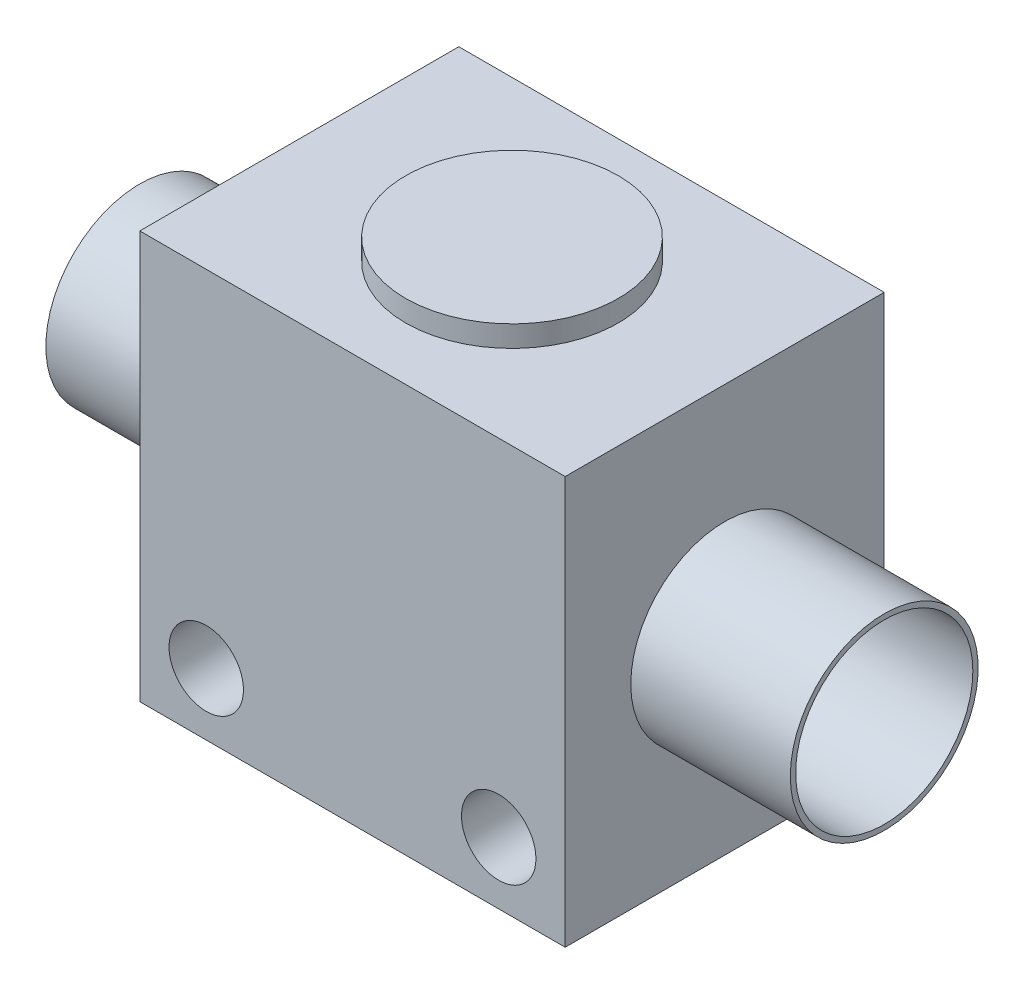
ISO-10303-21;
HEADER;
FILE_DESCRIPTION(('STEP AP214'),'2;1');
FILE_NAME('part.step','',(''),(''),'','','');
FILE_SCHEMA(('AUTOMOTIVE_DESIGN { 1 0 10303 214 1 1 1 1 }'));
ENDSEC;
DATA;
#1=APPLICATION_CONTEXT('core data for automotive mechanical design processes');
#2=APPLICATION_PROTOCOL_DEFINITION('international standard','automotive_design',2000,#1);
#3=PRODUCT_CONTEXT('',#1,'mechanical');
#4=PRODUCT('Part','Part','',(#3));
#5=PRODUCT_RELATED_PRODUCT_CATEGORY('part','',(#4));
#6=PRODUCT_DEFINITION_FORMATION('','',#4);
#7=PRODUCT_DEFINITION_CONTEXT('part definition',#1,'design');
#8=PRODUCT_DEFINITION('design','',#6,#7);
#9=PRODUCT_DEFINITION_SHAPE('','',#8);
#10=(LENGTH_UNIT() NAMED_UNIT(*) SI_UNIT(.MILLI.,.METRE.));
#11=(NAMED_UNIT(*) PLANE_ANGLE_UNIT() SI_UNIT($,.RADIAN.));
#12=(NAMED_UNIT(*) SI_UNIT($,.STERADIAN.) SOLID_ANGLE_UNIT());
#13=UNCERTAINTY_MEASURE_WITH_UNIT(LENGTH_MEASURE(1.E-05),#10,'distance_accuracy_value','');
#14=(GEOMETRIC_REPRESENTATION_CONTEXT(3) GLOBAL_UNCERTAINTY_ASSIGNED_CONTEXT((#13)) GLOBAL_UNIT_ASSIGNED_CONTEXT((#10,
#11,#12)) REPRESENTATION_CONTEXT('',''));
#15=CARTESIAN_POINT('',(0.,0.,0.));
#16=DIRECTION('',(0.,0.,1.));
#17=DIRECTION('',(1.,0.,0.));
#18=AXIS2_PLACEMENT_3D('',#15,#16,#17);
#19=CARTESIAN_POINT('',(8.,0.,0.));
#20=DIRECTION('',(1.,0.,0.));
#21=DIRECTION('',(0.,0.,-1.));
#22=AXIS2_PLACEMENT_3D('',#19,#20,#21);
#23=PLANE('',#22);
#24=CARTESIAN_POINT('',(8.,0.,0.));
#25=DIRECTION('',(1.,0.,0.));
#26=DIRECTION('',(0.,0.,-1.));
#27=AXIS2_PLACEMENT_3D('',#24,#25,#26);
#28=CIRCLE('',#27,5.);
#29=CARTESIAN_POINT('',(8.,0.,-5.));
#30=VERTEX_POINT('',#29);
#31=EDGE_CURVE('E20',#30,#30,#28,.T.);
#32=ORIENTED_EDGE('',*,*,#31,.T.);
#33=EDGE_LOOP('',(#32));
#34=FACE_BOUND('',#33,.T.);
#35=ADVANCED_FACE('F17',(#34),#23,.T.);
#36=CARTESIAN_POINT('',(-8.,0.,0.));
#37=DIRECTION('',(-1.,0.,0.));
#38=DIRECTION('',(0.,0.,1.));
#39=AXIS2_PLACEMENT_3D('',#36,#37,#38);
#40=PLANE('',#39);
#41=CARTESIAN_POINT('',(-8.,0.,0.));
#42=DIRECTION('',(-1.,0.,0.));
#43=DIRECTION('',(0.,0.,1.));
#44=AXIS2_PLACEMENT_3D('',#41,#42,#43);
#45=CIRCLE('',#44,5.);
#46=CARTESIAN_POINT('',(-8.,0.,5.));
#47=VERTEX_POINT('',#46);
#48=EDGE_CURVE('E116',#47,#47,#45,.T.);
#49=ORIENTED_EDGE('',*,*,#48,.T.);
#50=EDGE_LOOP('',(#49));
#51=FACE_BOUND('',#50,.T.);
#52=ADVANCED_FACE('F127',(#51),#40,.T.);
#53=CARTESIAN_POINT('',(8.,0.,0.));
#54=DIRECTION('',(1.,0.,0.));
#55=DIRECTION('',(0.,0.,-1.));
#56=AXIS2_PLACEMENT_3D('',#53,#54,#55);
#57=CYLINDRICAL_SURFACE('',#56,5.);
#58=CARTESIAN_POINT('',(21.,0.,0.));
#59=DIRECTION('',(1.,0.,0.));
#60=DIRECTION('',(0.,0.,-1.));
#61=AXIS2_PLACEMENT_3D('',#58,#59,#60);
#62=CIRCLE('',#61,5.);
#63=CARTESIAN_POINT('',(21.,0.,-5.));
#64=VERTEX_POINT('',#63);
#65=EDGE_CURVE('E114',#64,#64,#62,.F.);
#66=ORIENTED_EDGE('',*,*,#65,.F.);
#67=EDGE_LOOP('',(#66));
#68=FACE_BOUND('',#67,.T.);
#69=ORIENTED_EDGE('',*,*,#31,.F.);
#70=EDGE_LOOP('',(#69));
#71=FACE_BOUND('',#70,.T.);
#72=ADVANCED_FACE('F124',(#68,#71),#57,.F.);
#73=CARTESIAN_POINT('',(-8.,0.,0.));
#74=DIRECTION('',(-1.,0.,0.));
#75=DIRECTION('',(0.,0.,1.));
#76=AXIS2_PLACEMENT_3D('',#73,#74,#75);
#77=CYLINDRICAL_SURFACE('',#76,5.);
#78=CARTESIAN_POINT('',(-21.,0.,0.));
#79=DIRECTION('',(-1.,0.,0.));
#80=DIRECTION('',(0.,0.,1.));
#81=AXIS2_PLACEMENT_3D('',#78,#79,#80);
#82=CIRCLE('',#81,5.);
#83=CARTESIAN_POINT('',(-21.,0.,5.));
#84=VERTEX_POINT('',#83);
#85=EDGE_CURVE('E111',#84,#84,#82,.F.);
#86=ORIENTED_EDGE('',*,*,#85,.F.);
#87=EDGE_LOOP('',(#86));
#88=FACE_BOUND('',#87,.T.);
#89=ORIENTED_EDGE('',*,*,#48,.F.);
#90=EDGE_LOOP('',(#89));
#91=FACE_BOUND('',#90,.T.);
#92=ADVANCED_FACE('F126',(#88,#91),#77,.F.);
#93=CARTESIAN_POINT('',(0.,13.2,0.));
#94=DIRECTION('',(0.,1.,0.));
#95=DIRECTION('',(0.,0.,1.));
#96=AXIS2_PLACEMENT_3D('',#93,#94,#95);
#97=PLANE('',#96);
#98=CARTESIAN_POINT('',(0.,13.2,0.));
#99=DIRECTION('',(0.,-1.,0.));
#100=DIRECTION('',(0.,0.,-1.));
#101=AXIS2_PLACEMENT_3D('',#98,#99,#100);
#102=CIRCLE('',#101,6.);
#103=CARTESIAN_POINT('',(0.,13.2,-6.));
#104=VERTEX_POINT('',#103);
#105=EDGE_CURVE('E108',#104,#104,#102,.T.);
#106=ORIENTED_EDGE('',*,*,#105,.F.);
#107=EDGE_LOOP('',(#106));
#108=FACE_BOUND('',#107,.T.);
#109=ADVANCED_FACE('F135',(#108),#97,.T.);
#110=CARTESIAN_POINT('',(21.,0.,0.));
#111=DIRECTION('',(1.,0.,0.));
#112=DIRECTION('',(0.,0.,-1.));
#113=AXIS2_PLACEMENT_3D('',#110,#111,#112);
#114=PLANE('',#113);
#115=CARTESIAN_POINT('',(21.,0.,0.));
#116=DIRECTION('',(-1.,0.,0.));
#117=DIRECTION('',(0.,0.,1.));
#118=AXIS2_PLACEMENT_3D('',#115,#116,#117);
#119=CIRCLE('',#118,5.3);
#120=CARTESIAN_POINT('',(21.,0.,5.3));
#121=VERTEX_POINT('',#120);
#122=EDGE_CURVE('E105',#121,#121,#119,.T.);
#123=ORIENTED_EDGE('',*,*,#122,.F.);
#124=EDGE_LOOP('',(#123));
#125=FACE_BOUND('',#124,.T.);
#126=ORIENTED_EDGE('',*,*,#65,.T.);
#127=EDGE_LOOP('',(#126));
#128=FACE_BOUND('',#127,.T.);
#129=ADVANCED_FACE('F187',(#125,#128),#114,.T.);
#130=CARTESIAN_POINT('',(-21.,0.,0.));
#131=DIRECTION('',(-1.,0.,0.));
#132=DIRECTION('',(0.,0.,1.));
#133=AXIS2_PLACEMENT_3D('',#130,#131,#132);
#134=PLANE('',#133);
#135=CARTESIAN_POINT('',(-21.,0.,0.));
#136=DIRECTION('',(1.,0.,0.));
#137=DIRECTION('',(0.,0.,-1.));
#138=AXIS2_PLACEMENT_3D('',#135,#136,#137);
#139=CIRCLE('',#138,5.3);
#140=CARTESIAN_POINT('',(-21.,0.,-5.3));
#141=VERTEX_POINT('',#140);
#142=EDGE_CURVE('E102',#141,#141,#139,.T.);
#143=ORIENTED_EDGE('',*,*,#142,.F.);
#144=EDGE_LOOP('',(#143));
#145=FACE_BOUND('',#144,.T.);
#146=ORIENTED_EDGE('',*,*,#85,.T.);
#147=EDGE_LOOP('',(#146));
#148=FACE_BOUND('',#147,.T.);
#149=ADVANCED_FACE('F183',(#145,#148),#134,.T.);
#150=CARTESIAN_POINT('',(0.,13.2,0.));
#151=DIRECTION('',(0.,-1.,0.));
#152=DIRECTION('',(0.,0.,-1.));
#153=AXIS2_PLACEMENT_3D('',#150,#151,#152);
#154=CYLINDRICAL_SURFACE('',#153,6.);
#155=ORIENTED_EDGE('',*,*,#105,.T.);
#156=EDGE_LOOP('',(#155));
#157=FACE_BOUND('',#156,.T.);
#158=CARTESIAN_POINT('',(0.,12.,0.));
#159=DIRECTION('',(0.,-1.,0.));
#160=DIRECTION('',(0.,0.,-1.));
#161=AXIS2_PLACEMENT_3D('',#158,#159,#160);
#162=CIRCLE('',#161,6.);
#163=CARTESIAN_POINT('',(0.,12.,-6.));
#164=VERTEX_POINT('',#163);
#165=EDGE_CURVE('E66',#164,#164,#162,.F.);
#166=ORIENTED_EDGE('',*,*,#165,.T.);
#167=EDGE_LOOP('',(#166));
#168=FACE_BOUND('',#167,.T.);
#169=ADVANCED_FACE('F179',(#157,#168),#154,.T.);
#170=CARTESIAN_POINT('',(21.,0.,0.));
#171=DIRECTION('',(-1.,0.,0.));
#172=DIRECTION('',(0.,0.,1.));
#173=AXIS2_PLACEMENT_3D('',#170,#171,#172);
#174=CYLINDRICAL_SURFACE('',#173,5.3);
#175=ORIENTED_EDGE('',*,*,#122,.T.);
#176=EDGE_LOOP('',(#175));
#177=FACE_BOUND('',#176,.T.);
#178=CARTESIAN_POINT('',(12.,0.,0.));
#179=DIRECTION('',(-1.,0.,0.));
#180=DIRECTION('',(0.,0.,1.));
#181=AXIS2_PLACEMENT_3D('',#178,#179,#180);
#182=CIRCLE('',#181,5.3);
#183=CARTESIAN_POINT('',(12.,0.,5.3));
#184=VERTEX_POINT('',#183);
#185=EDGE_CURVE('E76',#184,#184,#182,.F.);
#186=ORIENTED_EDGE('',*,*,#185,.T.);
#187=EDGE_LOOP('',(#186));
#188=FACE_BOUND('',#187,.T.);
#189=ADVANCED_FACE('F176',(#177,#188),#174,.T.);
#190=CARTESIAN_POINT('',(-12.,12.,-9.));
#191=DIRECTION('',(0.,0.,-1.));
#192=DIRECTION('',(-1.,0.,0.));
#193=AXIS2_PLACEMENT_3D('',#190,#191,#192);
#194=PLANE('',#193);
#195=DIRECTION('',(0.,1.,0.));
#196=VECTOR('',#195,1.);
#197=CARTESIAN_POINT('',(12.,-11.,-9.));
#198=LINE('',#197,#196);
#199=CARTESIAN_POINT('',(12.,12.,-9.));
#200=VERTEX_POINT('',#199);
#201=CARTESIAN_POINT('',(12.,-11.,-9.));
#202=VERTEX_POINT('',#201);
#203=EDGE_CURVE('E55',#200,#202,#198,.F.);
#204=ORIENTED_EDGE('',*,*,#203,.T.);
#205=DIRECTION('',(1.,0.,0.));
#206=VECTOR('',#205,1.);
#207=CARTESIAN_POINT('',(-12.,-11.,-9.));
#208=LINE('',#207,#206);
#209=CARTESIAN_POINT('',(-12.,-11.,-9.));
#210=VERTEX_POINT('',#209);
#211=EDGE_CURVE('E290',#202,#210,#208,.F.);
#212=ORIENTED_EDGE('',*,*,#211,.T.);
#213=DIRECTION('',(0.,1.,0.));
#214=VECTOR('',#213,1.);
#215=CARTESIAN_POINT('',(-12.,-11.,-9.));
#216=LINE('',#215,#214);
#217=CARTESIAN_POINT('',(-12.,12.,-9.));
#218=VERTEX_POINT('',#217);
#219=EDGE_CURVE('E61',#210,#218,#216,.T.);
#220=ORIENTED_EDGE('',*,*,#219,.T.);
#221=DIRECTION('',(1.,0.,0.));
#222=VECTOR('',#221,1.);
#223=CARTESIAN_POINT('',(-12.,12.,-9.));
#224=LINE('',#223,#222);
#225=EDGE_CURVE('E58',#218,#200,#224,.T.);
#226=ORIENTED_EDGE('',*,*,#225,.T.);
#227=EDGE_LOOP('',(#204,#212,#220,#226));
#228=FACE_BOUND('',#227,.T.);
#229=CARTESIAN_POINT('',(-8.25,-7.5,-9.));
#230=DIRECTION('',(0.,0.,1.));
#231=DIRECTION('',(1.,0.,0.));
#232=AXIS2_PLACEMENT_3D('',#229,#230,#231);
#233=CIRCLE('',#232,2.1);
#234=CARTESIAN_POINT('',(-6.15,-7.5,-9.));
#235=VERTEX_POINT('',#234);
#236=EDGE_CURVE('E67',#235,#235,#233,.T.);
#237=ORIENTED_EDGE('',*,*,#236,.T.);
#238=EDGE_LOOP('',(#237));
#239=FACE_BOUND('',#238,.T.);
#240=CARTESIAN_POINT('',(8.25,-7.5,-9.));
#241=DIRECTION('',(0.,0.,1.));
#242=DIRECTION('',(1.,0.,0.));
#243=AXIS2_PLACEMENT_3D('',#240,#241,#242);
#244=CIRCLE('',#243,2.1);
#245=CARTESIAN_POINT('',(10.35,-7.5,-9.));
#246=VERTEX_POINT('',#245);
#247=EDGE_CURVE('E99',#246,#246,#244,.T.);
#248=ORIENTED_EDGE('',*,*,#247,.T.);
#249=EDGE_LOOP('',(#248));
#250=FACE_BOUND('',#249,.T.);
#251=ADVANCED_FACE('F59',(#228,#239,#250),#194,.T.);
#252=CARTESIAN_POINT('',(-21.,0.,0.));
#253=DIRECTION('',(1.,0.,0.));
#254=DIRECTION('',(0.,0.,-1.));
#255=AXIS2_PLACEMENT_3D('',#252,#253,#254);
#256=CYLINDRICAL_SURFACE('',#255,5.3);
#257=ORIENTED_EDGE('',*,*,#142,.T.);
#258=EDGE_LOOP('',(#257));
#259=FACE_BOUND('',#258,.T.);
#260=CARTESIAN_POINT('',(-12.,0.,0.));
#261=DIRECTION('',(1.,0.,0.));
#262=DIRECTION('',(0.,0.,-1.));
#263=AXIS2_PLACEMENT_3D('',#260,#261,#262);
#264=CIRCLE('',#263,5.3);
#265=CARTESIAN_POINT('',(-12.,0.,-5.3));
#266=VERTEX_POINT('',#265);
#267=EDGE_CURVE('E92',#266,#266,#264,.F.);
#268=ORIENTED_EDGE('',*,*,#267,.T.);
#269=EDGE_LOOP('',(#268));
#270=FACE_BOUND('',#269,.T.);
#271=ADVANCED_FACE('F169',(#259,#270),#256,.T.);
#272=CARTESIAN_POINT('',(8.25,-7.5,-9.));
#273=DIRECTION('',(0.,0.,1.));
#274=DIRECTION('',(1.,0.,0.));
#275=AXIS2_PLACEMENT_3D('',#272,#273,#274);
#276=CYLINDRICAL_SURFACE('',#275,2.1);
#277=ORIENTED_EDGE('',*,*,#247,.F.);
#278=EDGE_LOOP('',(#277));
#279=FACE_BOUND('',#278,.T.);
#280=CARTESIAN_POINT('',(8.25,-7.5,9.));
#281=DIRECTION('',(0.,0.,1.));
#282=DIRECTION('',(1.,0.,0.));
#283=AXIS2_PLACEMENT_3D('',#280,#281,#282);
#284=CIRCLE('',#283,2.1);
#285=CARTESIAN_POINT('',(10.35,-7.5,9.));
#286=VERTEX_POINT('',#285);
#287=EDGE_CURVE('E89',#286,#286,#284,.T.);
#288=ORIENTED_EDGE('',*,*,#287,.T.);
#289=EDGE_LOOP('',(#288));
#290=FACE_BOUND('',#289,.T.);
#291=ADVANCED_FACE('F165',(#279,#290),#276,.F.);
#292=CARTESIAN_POINT('',(-8.25,-7.5,-9.));
#293=DIRECTION('',(0.,0.,1.));
#294=DIRECTION('',(1.,0.,0.));
#295=AXIS2_PLACEMENT_3D('',#292,#293,#294);
#296=CYLINDRICAL_SURFACE('',#295,2.1);
#297=ORIENTED_EDGE('',*,*,#236,.F.);
#298=EDGE_LOOP('',(#297));
#299=FACE_BOUND('',#298,.T.);
#300=CARTESIAN_POINT('',(-8.25,-7.5,9.));
#301=DIRECTION('',(0.,0.,1.));
#302=DIRECTION('',(1.,0.,0.));
#303=AXIS2_PLACEMENT_3D('',#300,#301,#302);
#304=CIRCLE('',#303,2.1);
#305=CARTESIAN_POINT('',(-6.15,-7.5,9.));
#306=VERTEX_POINT('',#305);
#307=EDGE_CURVE('E86',#306,#306,#304,.T.);
#308=ORIENTED_EDGE('',*,*,#307,.T.);
#309=EDGE_LOOP('',(#308));
#310=FACE_BOUND('',#309,.T.);
#311=ADVANCED_FACE('F161',(#299,#310),#296,.F.);
#312=CARTESIAN_POINT('',(-12.,12.,9.));
#313=DIRECTION('',(0.,-1.,0.));
#314=DIRECTION('',(0.,0.,-1.));
#315=AXIS2_PLACEMENT_3D('',#312,#313,#314);
#316=PLANE('',#315);
#317=ORIENTED_EDGE('',*,*,#165,.F.);
#318=EDGE_LOOP('',(#317));
#319=FACE_BOUND('',#318,.T.);
#320=DIRECTION('',(0.,0.,-1.));
#321=VECTOR('',#320,1.);
#322=CARTESIAN_POINT('',(-12.,12.,9.));
#323=LINE('',#322,#321);
#324=CARTESIAN_POINT('',(-12.,12.,9.));
#325=VERTEX_POINT('',#324);
#326=EDGE_CURVE('E298',#218,#325,#323,.F.);
#327=ORIENTED_EDGE('',*,*,#326,.T.);
#328=DIRECTION('',(-1.,0.,0.));
#329=VECTOR('',#328,1.);
#330=CARTESIAN_POINT('',(-12.,12.,9.));
#331=LINE('',#330,#329);
#332=CARTESIAN_POINT('',(12.,12.,9.));
#333=VERTEX_POINT('',#332);
#334=EDGE_CURVE('E80',#325,#333,#331,.F.);
#335=ORIENTED_EDGE('',*,*,#334,.T.);
#336=DIRECTION('',(0.,0.,1.));
#337=VECTOR('',#336,1.);
#338=CARTESIAN_POINT('',(12.,12.,9.));
#339=LINE('',#338,#337);
#340=EDGE_CURVE('E73',#333,#200,#339,.F.);
#341=ORIENTED_EDGE('',*,*,#340,.T.);
#342=ORIENTED_EDGE('',*,*,#225,.F.);
#343=EDGE_LOOP('',(#327,#335,#341,#342));
#344=FACE_BOUND('',#343,.T.);
#345=ADVANCED_FACE('F79',(#319,#344),#316,.F.);
#346=CARTESIAN_POINT('',(12.,-11.,9.));
#347=DIRECTION('',(-1.,0.,0.));
#348=DIRECTION('',(0.,0.,1.));
#349=AXIS2_PLACEMENT_3D('',#346,#347,#348);
#350=PLANE('',#349);
#351=ORIENTED_EDGE('',*,*,#185,.F.);
#352=EDGE_LOOP('',(#351));
#353=FACE_BOUND('',#352,.T.);
#354=ORIENTED_EDGE('',*,*,#340,.F.);
#355=DIRECTION('',(0.,1.,0.));
#356=VECTOR('',#355,1.);
#357=CARTESIAN_POINT('',(12.,12.,9.));
#358=LINE('',#357,#356);
#359=CARTESIAN_POINT('',(12.,-11.,9.));
#360=VERTEX_POINT('',#359);
#361=EDGE_CURVE('E291',#333,#360,#358,.F.);
#362=ORIENTED_EDGE('',*,*,#361,.T.);
#363=DIRECTION('',(0.,0.,1.));
#364=VECTOR('',#363,1.);
#365=CARTESIAN_POINT('',(12.,-11.,9.));
#366=LINE('',#365,#364);
#367=EDGE_CURVE('E75',#360,#202,#366,.F.);
#368=ORIENTED_EDGE('',*,*,#367,.T.);
#369=ORIENTED_EDGE('',*,*,#203,.F.);
#370=EDGE_LOOP('',(#354,#362,#368,#369));
#371=FACE_BOUND('',#370,.T.);
#372=ADVANCED_FACE('F71',(#353,#371),#350,.F.);
#373=CARTESIAN_POINT('',(-12.,-11.,9.));
#374=DIRECTION('',(0.,1.,0.));
#375=DIRECTION('',(0.,0.,1.));
#376=AXIS2_PLACEMENT_3D('',#373,#374,#375);
#377=PLANE('',#376);
#378=ORIENTED_EDGE('',*,*,#367,.F.);
#379=DIRECTION('',(-1.,0.,0.));
#380=VECTOR('',#379,1.);
#381=CARTESIAN_POINT('',(-12.,-11.,9.));
#382=LINE('',#381,#380);
#383=CARTESIAN_POINT('',(-12.,-11.,9.));
#384=VERTEX_POINT('',#383);
#385=EDGE_CURVE('E26',#360,#384,#382,.T.);
#386=ORIENTED_EDGE('',*,*,#385,.T.);
#387=DIRECTION('',(0.,0.,-1.));
#388=VECTOR('',#387,1.);
#389=CARTESIAN_POINT('',(-12.,-11.,9.));
#390=LINE('',#389,#388);
#391=EDGE_CURVE('E34',#384,#210,#390,.T.);
#392=ORIENTED_EDGE('',*,*,#391,.T.);
#393=ORIENTED_EDGE('',*,*,#211,.F.);
#394=EDGE_LOOP('',(#378,#386,#392,#393));
#395=FACE_BOUND('',#394,.T.);
#396=ADVANCED_FACE('F147',(#395),#377,.F.);
#397=CARTESIAN_POINT('',(-12.,-11.,9.));
#398=DIRECTION('',(1.,0.,0.));
#399=DIRECTION('',(0.,0.,-1.));
#400=AXIS2_PLACEMENT_3D('',#397,#398,#399);
#401=PLANE('',#400);
#402=ORIENTED_EDGE('',*,*,#267,.F.);
#403=EDGE_LOOP('',(#402));
#404=FACE_BOUND('',#403,.T.);
#405=ORIENTED_EDGE('',*,*,#391,.F.);
#406=DIRECTION('',(0.,1.,0.));
#407=VECTOR('',#406,1.);
#408=CARTESIAN_POINT('',(-12.,12.,9.));
#409=LINE('',#408,#407);
#410=EDGE_CURVE('E11',#384,#325,#409,.T.);
#411=ORIENTED_EDGE('',*,*,#410,.T.);
#412=ORIENTED_EDGE('',*,*,#326,.F.);
#413=ORIENTED_EDGE('',*,*,#219,.F.);
#414=EDGE_LOOP('',(#405,#411,#412,#413));
#415=FACE_BOUND('',#414,.T.);
#416=ADVANCED_FACE('F141',(#404,#415),#401,.F.);
#417=CARTESIAN_POINT('',(-12.,12.,9.));
#418=DIRECTION('',(0.,0.,-1.));
#419=DIRECTION('',(-1.,0.,0.));
#420=AXIS2_PLACEMENT_3D('',#417,#418,#419);
#421=PLANE('',#420);
#422=ORIENTED_EDGE('',*,*,#385,.F.);
#423=ORIENTED_EDGE('',*,*,#361,.F.);
#424=ORIENTED_EDGE('',*,*,#334,.F.);
#425=ORIENTED_EDGE('',*,*,#410,.F.);
#426=EDGE_LOOP('',(#422,#423,#424,#425));
#427=FACE_BOUND('',#426,.T.);
#428=ORIENTED_EDGE('',*,*,#307,.F.);
#429=EDGE_LOOP('',(#428));
#430=FACE_BOUND('',#429,.T.);
#431=ORIENTED_EDGE('',*,*,#287,.F.);
#432=EDGE_LOOP('',(#431));
#433=FACE_BOUND('',#432,.T.);
#434=ADVANCED_FACE('F139',(#427,#430,#433),#421,.F.);
#435=CLOSED_SHELL('',(#35,#52,#72,#92,#109,#129,#149,#169,#189,#251,#271,#291,#311,#345,#372,
#396,#416,#434));
#436=MANIFOLD_SOLID_BREP('B1',#435);
#437=ADVANCED_BREP_SHAPE_REPRESENTATION('',(#18,#436),#14);
#438=SHAPE_DEFINITION_REPRESENTATION(#9,#437);
ENDSEC;
END-ISO-10303-21;
